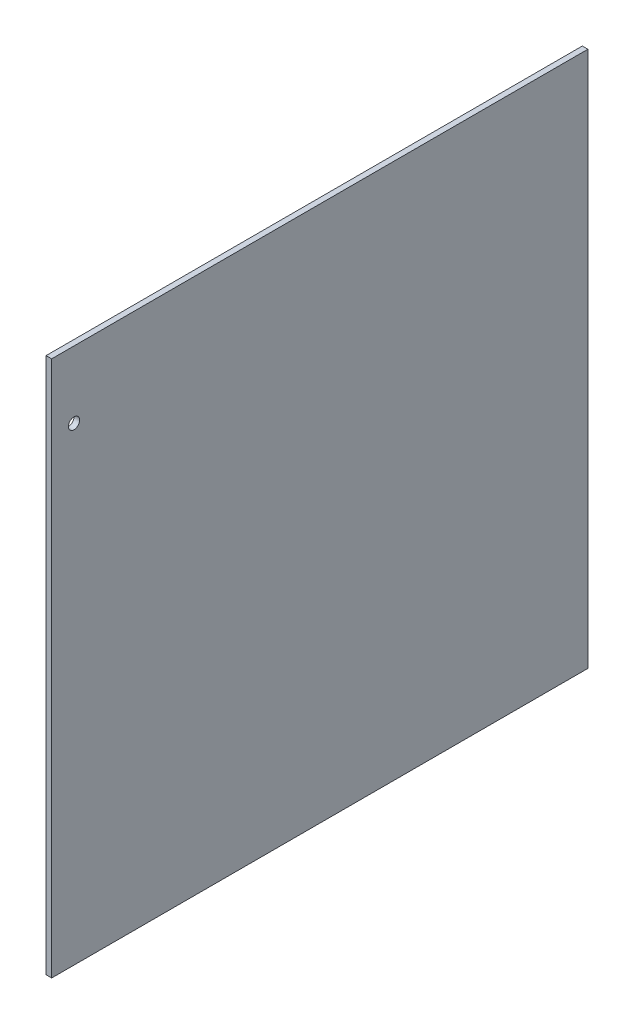
ISO-10303-21;
HEADER;
FILE_DESCRIPTION(('STEP AP214'),'2;1');
FILE_NAME('part.step','',(''),(''),'','','');
FILE_SCHEMA(('AUTOMOTIVE_DESIGN { 1 0 10303 214 1 1 1 1 }'));
ENDSEC;
DATA;
#1=APPLICATION_CONTEXT('core data for automotive mechanical design processes');
#2=APPLICATION_PROTOCOL_DEFINITION('international standard','automotive_design',2000,#1);
#3=PRODUCT_CONTEXT('',#1,'mechanical');
#4=PRODUCT('Part','Part','',(#3));
#5=PRODUCT_RELATED_PRODUCT_CATEGORY('part','',(#4));
#6=PRODUCT_DEFINITION_FORMATION('','',#4);
#7=PRODUCT_DEFINITION_CONTEXT('part definition',#1,'design');
#8=PRODUCT_DEFINITION('design','',#6,#7);
#9=PRODUCT_DEFINITION_SHAPE('','',#8);
#10=(LENGTH_UNIT() NAMED_UNIT(*) SI_UNIT(.MILLI.,.METRE.));
#11=(NAMED_UNIT(*) PLANE_ANGLE_UNIT() SI_UNIT($,.RADIAN.));
#12=(NAMED_UNIT(*) SI_UNIT($,.STERADIAN.) SOLID_ANGLE_UNIT());
#13=UNCERTAINTY_MEASURE_WITH_UNIT(LENGTH_MEASURE(1.E-05),#10,'distance_accuracy_value','');
#14=(GEOMETRIC_REPRESENTATION_CONTEXT(3) GLOBAL_UNCERTAINTY_ASSIGNED_CONTEXT((#13)) GLOBAL_UNIT_ASSIGNED_CONTEXT((#10,
#11,#12)) REPRESENTATION_CONTEXT('',''));
#15=CARTESIAN_POINT('',(0.,0.,0.));
#16=DIRECTION('',(0.,0.,1.));
#17=DIRECTION('',(1.,0.,0.));
#18=AXIS2_PLACEMENT_3D('',#15,#16,#17);
#19=CARTESIAN_POINT('',(3.175,152.4,152.4));
#20=DIRECTION('',(0.,0.,-1.));
#21=DIRECTION('',(-1.,0.,0.));
#22=AXIS2_PLACEMENT_3D('',#19,#20,#21);
#23=PLANE('',#22);
#24=DIRECTION('',(0.,-1.,0.));
#25=VECTOR('',#24,1.);
#26=CARTESIAN_POINT('',(0.,152.4,152.4));
#27=LINE('',#26,#25);
#28=CARTESIAN_POINT('',(0.,152.4,152.4));
#29=VERTEX_POINT('',#28);
#30=CARTESIAN_POINT('',(0.,-152.4,152.4));
#31=VERTEX_POINT('',#30);
#32=EDGE_CURVE('E106',#29,#31,#27,.T.);
#33=ORIENTED_EDGE('',*,*,#32,.T.);
#34=DIRECTION('',(-1.,0.,0.));
#35=VECTOR('',#34,1.);
#36=CARTESIAN_POINT('',(3.175,-152.4,152.4));
#37=LINE('',#36,#35);
#38=CARTESIAN_POINT('',(3.175,-152.4,152.4));
#39=VERTEX_POINT('',#38);
#40=EDGE_CURVE('E11',#39,#31,#37,.T.);
#41=ORIENTED_EDGE('',*,*,#40,.F.);
#42=DIRECTION('',(0.,-1.,0.));
#43=VECTOR('',#42,1.);
#44=CARTESIAN_POINT('',(3.175,152.4,152.4));
#45=LINE('',#44,#43);
#46=CARTESIAN_POINT('',(3.175,152.4,152.4));
#47=VERTEX_POINT('',#46);
#48=EDGE_CURVE('E90',#47,#39,#45,.T.);
#49=ORIENTED_EDGE('',*,*,#48,.F.);
#50=DIRECTION('',(-1.,0.,0.));
#51=VECTOR('',#50,1.);
#52=CARTESIAN_POINT('',(3.175,152.4,152.4));
#53=LINE('',#52,#51);
#54=EDGE_CURVE('E102',#47,#29,#53,.T.);
#55=ORIENTED_EDGE('',*,*,#54,.T.);
#56=EDGE_LOOP('',(#33,#41,#49,#55));
#57=FACE_BOUND('',#56,.T.);
#58=ADVANCED_FACE('F38',(#57),#23,.F.);
#59=CARTESIAN_POINT('',(3.175,-152.4,-152.4));
#60=DIRECTION('',(0.,1.,0.));
#61=DIRECTION('',(0.,0.,1.));
#62=AXIS2_PLACEMENT_3D('',#59,#60,#61);
#63=PLANE('',#62);
#64=DIRECTION('',(0.,0.,-1.));
#65=VECTOR('',#64,1.);
#66=CARTESIAN_POINT('',(0.,-152.4,-152.4));
#67=LINE('',#66,#65);
#68=CARTESIAN_POINT('',(0.,-152.4,-152.4));
#69=VERTEX_POINT('',#68);
#70=EDGE_CURVE('E95',#31,#69,#67,.T.);
#71=ORIENTED_EDGE('',*,*,#70,.T.);
#72=DIRECTION('',(-1.,0.,0.));
#73=VECTOR('',#72,1.);
#74=CARTESIAN_POINT('',(3.175,-152.4,-152.4));
#75=LINE('',#74,#73);
#76=CARTESIAN_POINT('',(3.175,-152.4,-152.4));
#77=VERTEX_POINT('',#76);
#78=EDGE_CURVE('E47',#77,#69,#75,.T.);
#79=ORIENTED_EDGE('',*,*,#78,.F.);
#80=DIRECTION('',(0.,0.,-1.));
#81=VECTOR('',#80,1.);
#82=CARTESIAN_POINT('',(3.175,-152.4,-152.4));
#83=LINE('',#82,#81);
#84=EDGE_CURVE('E85',#39,#77,#83,.T.);
#85=ORIENTED_EDGE('',*,*,#84,.F.);
#86=ORIENTED_EDGE('',*,*,#40,.T.);
#87=EDGE_LOOP('',(#71,#79,#85,#86));
#88=FACE_BOUND('',#87,.T.);
#89=ADVANCED_FACE('F94',(#88),#63,.F.);
#90=CARTESIAN_POINT('',(3.175,152.4,-152.4));
#91=DIRECTION('',(0.,0.,1.));
#92=DIRECTION('',(0.,-1.,0.));
#93=AXIS2_PLACEMENT_3D('',#90,#91,#92);
#94=PLANE('',#93);
#95=DIRECTION('',(0.,1.,0.));
#96=VECTOR('',#95,1.);
#97=CARTESIAN_POINT('',(0.,152.4,-152.4));
#98=LINE('',#97,#96);
#99=CARTESIAN_POINT('',(0.,152.4,-152.4));
#100=VERTEX_POINT('',#99);
#101=EDGE_CURVE('E72',#69,#100,#98,.T.);
#102=ORIENTED_EDGE('',*,*,#101,.T.);
#103=DIRECTION('',(-1.,0.,0.));
#104=VECTOR('',#103,1.);
#105=CARTESIAN_POINT('',(3.175,152.4,-152.4));
#106=LINE('',#105,#104);
#107=CARTESIAN_POINT('',(3.175,152.4,-152.4));
#108=VERTEX_POINT('',#107);
#109=EDGE_CURVE('E97',#108,#100,#106,.T.);
#110=ORIENTED_EDGE('',*,*,#109,.F.);
#111=DIRECTION('',(0.,1.,0.));
#112=VECTOR('',#111,1.);
#113=CARTESIAN_POINT('',(3.175,152.4,-152.4));
#114=LINE('',#113,#112);
#115=EDGE_CURVE('E88',#77,#108,#114,.T.);
#116=ORIENTED_EDGE('',*,*,#115,.F.);
#117=ORIENTED_EDGE('',*,*,#78,.T.);
#118=EDGE_LOOP('',(#102,#110,#116,#117));
#119=FACE_BOUND('',#118,.T.);
#120=ADVANCED_FACE('F98',(#119),#94,.F.);
#121=CARTESIAN_POINT('',(3.175,152.4,-152.4));
#122=DIRECTION('',(0.,-1.,0.));
#123=DIRECTION('',(0.,0.,-1.));
#124=AXIS2_PLACEMENT_3D('',#121,#122,#123);
#125=PLANE('',#124);
#126=DIRECTION('',(0.,0.,1.));
#127=VECTOR('',#126,1.);
#128=CARTESIAN_POINT('',(0.,152.4,-152.4));
#129=LINE('',#128,#127);
#130=EDGE_CURVE('E78',#100,#29,#129,.T.);
#131=ORIENTED_EDGE('',*,*,#130,.T.);
#132=ORIENTED_EDGE('',*,*,#54,.F.);
#133=DIRECTION('',(0.,0.,1.));
#134=VECTOR('',#133,1.);
#135=CARTESIAN_POINT('',(3.175,152.4,-152.4));
#136=LINE('',#135,#134);
#137=EDGE_CURVE('E55',#108,#47,#136,.T.);
#138=ORIENTED_EDGE('',*,*,#137,.F.);
#139=ORIENTED_EDGE('',*,*,#109,.T.);
#140=EDGE_LOOP('',(#131,#132,#138,#139));
#141=FACE_BOUND('',#140,.T.);
#142=ADVANCED_FACE('F120',(#141),#125,.F.);
#143=CARTESIAN_POINT('',(3.175,0.,0.));
#144=DIRECTION('',(-1.,0.,0.));
#145=DIRECTION('',(0.,0.,1.));
#146=AXIS2_PLACEMENT_3D('',#143,#144,#145);
#147=PLANE('',#146);
#148=CARTESIAN_POINT('',(3.175,114.3,139.7));
#149=DIRECTION('',(-1.,0.,0.));
#150=DIRECTION('',(0.,0.,1.));
#151=AXIS2_PLACEMENT_3D('',#148,#149,#150);
#152=CIRCLE('',#151,3.175);
#153=CARTESIAN_POINT('',(3.175,114.3,142.875));
#154=VERTEX_POINT('',#153);
#155=EDGE_CURVE('E110',#154,#154,#152,.T.);
#156=ORIENTED_EDGE('',*,*,#155,.T.);
#157=EDGE_LOOP('',(#156));
#158=FACE_BOUND('',#157,.T.);
#159=ORIENTED_EDGE('',*,*,#48,.T.);
#160=ORIENTED_EDGE('',*,*,#84,.T.);
#161=ORIENTED_EDGE('',*,*,#115,.T.);
#162=ORIENTED_EDGE('',*,*,#137,.T.);
#163=EDGE_LOOP('',(#159,#160,#161,#162));
#164=FACE_BOUND('',#163,.T.);
#165=ADVANCED_FACE('F86',(#158,#164),#147,.F.);
#166=CARTESIAN_POINT('',(0.,0.,0.));
#167=DIRECTION('',(-1.,0.,0.));
#168=DIRECTION('',(0.,0.,1.));
#169=AXIS2_PLACEMENT_3D('',#166,#167,#168);
#170=PLANE('',#169);
#171=CARTESIAN_POINT('',(0.,114.3,139.7));
#172=DIRECTION('',(-1.,0.,0.));
#173=DIRECTION('',(0.,0.,1.));
#174=AXIS2_PLACEMENT_3D('',#171,#172,#173);
#175=CIRCLE('',#174,3.175);
#176=CARTESIAN_POINT('',(0.,114.3,142.875));
#177=VERTEX_POINT('',#176);
#178=EDGE_CURVE('E127',#177,#177,#175,.T.);
#179=ORIENTED_EDGE('',*,*,#178,.F.);
#180=EDGE_LOOP('',(#179));
#181=FACE_BOUND('',#180,.T.);
#182=ORIENTED_EDGE('',*,*,#32,.F.);
#183=ORIENTED_EDGE('',*,*,#130,.F.);
#184=ORIENTED_EDGE('',*,*,#101,.F.);
#185=ORIENTED_EDGE('',*,*,#70,.F.);
#186=EDGE_LOOP('',(#182,#183,#184,#185));
#187=FACE_BOUND('',#186,.T.);
#188=ADVANCED_FACE('F123',(#181,#187),#170,.T.);
#189=CARTESIAN_POINT('',(3.175,114.3,139.7));
#190=DIRECTION('',(-1.,0.,0.));
#191=DIRECTION('',(0.,0.,1.));
#192=AXIS2_PLACEMENT_3D('',#189,#190,#191);
#193=CYLINDRICAL_SURFACE('',#192,3.175);
#194=ORIENTED_EDGE('',*,*,#155,.F.);
#195=EDGE_LOOP('',(#194));
#196=FACE_BOUND('',#195,.T.);
#197=ORIENTED_EDGE('',*,*,#178,.T.);
#198=EDGE_LOOP('',(#197));
#199=FACE_BOUND('',#198,.T.);
#200=ADVANCED_FACE('F136',(#196,#199),#193,.F.);
#201=CLOSED_SHELL('',(#58,#89,#120,#142,#165,#188,#200));
#202=MANIFOLD_SOLID_BREP('B2',#201);
#203=ADVANCED_BREP_SHAPE_REPRESENTATION('',(#18,#202),#14);
#204=SHAPE_DEFINITION_REPRESENTATION(#9,#203);
ENDSEC;
END-ISO-10303-21;
